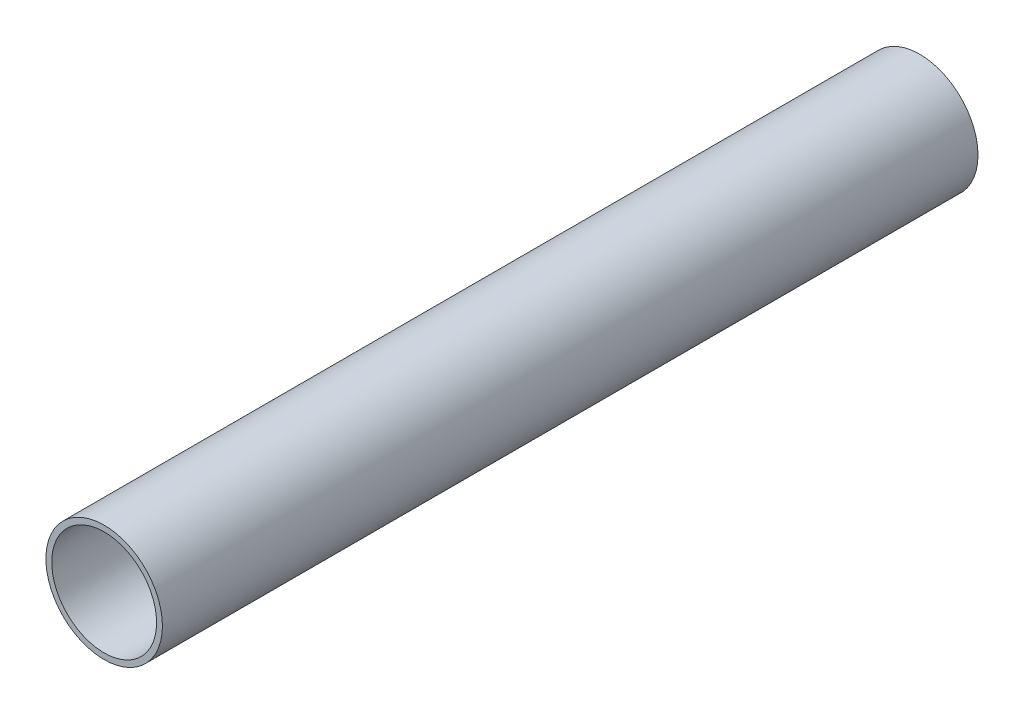
ISO-10303-21;
HEADER;
FILE_DESCRIPTION(('STEP AP214'),'2;1');
FILE_NAME('part.step','',(''),(''),'','','');
FILE_SCHEMA(('AUTOMOTIVE_DESIGN { 1 0 10303 214 1 1 1 1 }'));
ENDSEC;
DATA;
#1=APPLICATION_CONTEXT('core data for automotive mechanical design processes');
#2=APPLICATION_PROTOCOL_DEFINITION('international standard','automotive_design',2000,#1);
#3=PRODUCT_CONTEXT('',#1,'mechanical');
#4=PRODUCT('Part','Part','',(#3));
#5=PRODUCT_RELATED_PRODUCT_CATEGORY('part','',(#4));
#6=PRODUCT_DEFINITION_FORMATION('','',#4);
#7=PRODUCT_DEFINITION_CONTEXT('part definition',#1,'design');
#8=PRODUCT_DEFINITION('design','',#6,#7);
#9=PRODUCT_DEFINITION_SHAPE('','',#8);
#10=(LENGTH_UNIT() NAMED_UNIT(*) SI_UNIT(.MILLI.,.METRE.));
#11=(NAMED_UNIT(*) PLANE_ANGLE_UNIT() SI_UNIT($,.RADIAN.));
#12=(NAMED_UNIT(*) SI_UNIT($,.STERADIAN.) SOLID_ANGLE_UNIT());
#13=UNCERTAINTY_MEASURE_WITH_UNIT(LENGTH_MEASURE(1.E-05),#10,'distance_accuracy_value','');
#14=(GEOMETRIC_REPRESENTATION_CONTEXT(3) GLOBAL_UNCERTAINTY_ASSIGNED_CONTEXT((#13)) GLOBAL_UNIT_ASSIGNED_CONTEXT((#10,
#11,#12)) REPRESENTATION_CONTEXT('',''));
#15=CARTESIAN_POINT('',(0.,0.,0.));
#16=DIRECTION('',(0.,0.,1.));
#17=DIRECTION('',(1.,0.,0.));
#18=AXIS2_PLACEMENT_3D('',#15,#16,#17);
#19=CARTESIAN_POINT('',(0.,0.,140.));
#20=DIRECTION('',(0.,0.,1.));
#21=DIRECTION('',(1.,0.,0.));
#22=AXIS2_PLACEMENT_3D('',#19,#20,#21);
#23=PLANE('',#22);
#24=CARTESIAN_POINT('',(0.,0.,140.));
#25=DIRECTION('',(0.,0.,1.));
#26=DIRECTION('',(1.,0.,0.));
#27=AXIS2_PLACEMENT_3D('',#24,#25,#26);
#28=CIRCLE('',#27,10.);
#29=CARTESIAN_POINT('',(10.,0.,140.));
#30=VERTEX_POINT('',#29);
#31=EDGE_CURVE('E11',#30,#30,#28,.T.);
#32=ORIENTED_EDGE('',*,*,#31,.T.);
#33=EDGE_LOOP('',(#32));
#34=FACE_BOUND('',#33,.T.);
#35=CARTESIAN_POINT('',(0.,0.,140.));
#36=DIRECTION('',(0.,0.,1.));
#37=DIRECTION('',(1.,0.,0.));
#38=AXIS2_PLACEMENT_3D('',#35,#36,#37);
#39=CIRCLE('',#38,9.);
#40=CARTESIAN_POINT('',(9.,0.,140.));
#41=VERTEX_POINT('',#40);
#42=EDGE_CURVE('E51',#41,#41,#39,.T.);
#43=ORIENTED_EDGE('',*,*,#42,.F.);
#44=EDGE_LOOP('',(#43));
#45=FACE_BOUND('',#44,.T.);
#46=ADVANCED_FACE('F40',(#34,#45),#23,.T.);
#47=CARTESIAN_POINT('',(0.,0.,0.));
#48=DIRECTION('',(0.,0.,1.));
#49=DIRECTION('',(1.,0.,0.));
#50=AXIS2_PLACEMENT_3D('',#47,#48,#49);
#51=PLANE('',#50);
#52=CARTESIAN_POINT('',(0.,0.,0.));
#53=DIRECTION('',(0.,0.,1.));
#54=DIRECTION('',(1.,0.,0.));
#55=AXIS2_PLACEMENT_3D('',#52,#53,#54);
#56=CIRCLE('',#55,10.);
#57=CARTESIAN_POINT('',(10.,0.,0.));
#58=VERTEX_POINT('',#57);
#59=EDGE_CURVE('E44',#58,#58,#56,.T.);
#60=ORIENTED_EDGE('',*,*,#59,.F.);
#61=EDGE_LOOP('',(#60));
#62=FACE_BOUND('',#61,.T.);
#63=CARTESIAN_POINT('',(0.,0.,0.));
#64=DIRECTION('',(0.,0.,1.));
#65=DIRECTION('',(1.,0.,0.));
#66=AXIS2_PLACEMENT_3D('',#63,#64,#65);
#67=CIRCLE('',#66,9.);
#68=CARTESIAN_POINT('',(9.,0.,0.));
#69=VERTEX_POINT('',#68);
#70=EDGE_CURVE('E53',#69,#69,#67,.T.);
#71=ORIENTED_EDGE('',*,*,#70,.T.);
#72=EDGE_LOOP('',(#71));
#73=FACE_BOUND('',#72,.T.);
#74=ADVANCED_FACE('F63',(#62,#73),#51,.F.);
#75=CARTESIAN_POINT('',(0.,0.,140.));
#76=DIRECTION('',(0.,0.,-1.));
#77=DIRECTION('',(-1.,0.,0.));
#78=AXIS2_PLACEMENT_3D('',#75,#76,#77);
#79=CYLINDRICAL_SURFACE('',#78,10.);
#80=ORIENTED_EDGE('',*,*,#31,.F.);
#81=EDGE_LOOP('',(#80));
#82=FACE_BOUND('',#81,.T.);
#83=ORIENTED_EDGE('',*,*,#59,.T.);
#84=EDGE_LOOP('',(#83));
#85=FACE_BOUND('',#84,.T.);
#86=ADVANCED_FACE('F42',(#82,#85),#79,.T.);
#87=CARTESIAN_POINT('',(0.,0.,140.));
#88=DIRECTION('',(0.,0.,-1.));
#89=DIRECTION('',(-1.,0.,0.));
#90=AXIS2_PLACEMENT_3D('',#87,#88,#89);
#91=CYLINDRICAL_SURFACE('',#90,9.);
#92=ORIENTED_EDGE('',*,*,#42,.T.);
#93=EDGE_LOOP('',(#92));
#94=FACE_BOUND('',#93,.T.);
#95=ORIENTED_EDGE('',*,*,#70,.F.);
#96=EDGE_LOOP('',(#95));
#97=FACE_BOUND('',#96,.T.);
#98=ADVANCED_FACE('F59',(#94,#97),#91,.F.);
#99=CLOSED_SHELL('',(#46,#74,#86,#98));
#100=MANIFOLD_SOLID_BREP('B2',#99);
#101=ADVANCED_BREP_SHAPE_REPRESENTATION('',(#18,#100),#14);
#102=SHAPE_DEFINITION_REPRESENTATION(#9,#101);
ENDSEC;
END-ISO-10303-21;
